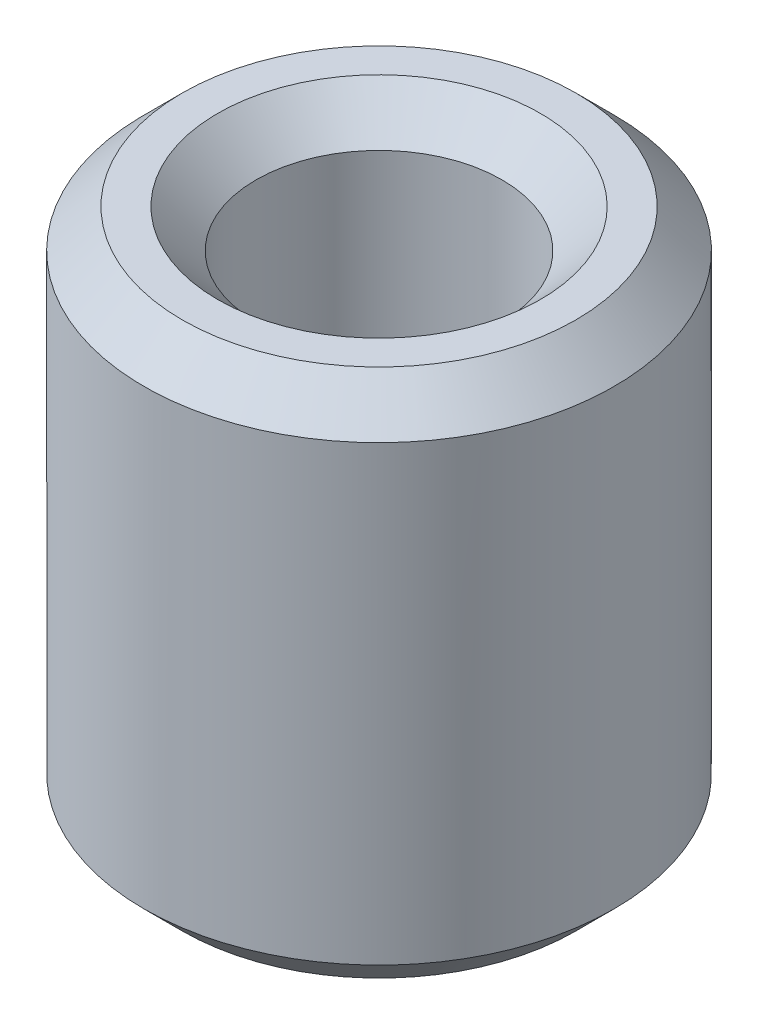
ISO-10303-21;
HEADER;
FILE_DESCRIPTION(('STEP AP214'),'2;1');
FILE_NAME('part.step','',(''),(''),'','','');
FILE_SCHEMA(('AUTOMOTIVE_DESIGN { 1 0 10303 214 1 1 1 1 }'));
ENDSEC;
DATA;
#1=APPLICATION_CONTEXT('core data for automotive mechanical design processes');
#2=APPLICATION_PROTOCOL_DEFINITION('international standard','automotive_design',2000,#1);
#3=PRODUCT_CONTEXT('',#1,'mechanical');
#4=PRODUCT('Part','Part','',(#3));
#5=PRODUCT_RELATED_PRODUCT_CATEGORY('part','',(#4));
#6=PRODUCT_DEFINITION_FORMATION('','',#4);
#7=PRODUCT_DEFINITION_CONTEXT('part definition',#1,'design');
#8=PRODUCT_DEFINITION('design','',#6,#7);
#9=PRODUCT_DEFINITION_SHAPE('','',#8);
#10=(LENGTH_UNIT() NAMED_UNIT(*) SI_UNIT(.MILLI.,.METRE.));
#11=(NAMED_UNIT(*) PLANE_ANGLE_UNIT() SI_UNIT($,.RADIAN.));
#12=(NAMED_UNIT(*) SI_UNIT($,.STERADIAN.) SOLID_ANGLE_UNIT());
#13=UNCERTAINTY_MEASURE_WITH_UNIT(LENGTH_MEASURE(1.E-05),#10,'distance_accuracy_value','');
#14=(GEOMETRIC_REPRESENTATION_CONTEXT(3) GLOBAL_UNCERTAINTY_ASSIGNED_CONTEXT((#13)) GLOBAL_UNIT_ASSIGNED_CONTEXT((#10,
#11,#12)) REPRESENTATION_CONTEXT('',''));
#15=CARTESIAN_POINT('',(0.,0.,0.));
#16=DIRECTION('',(0.,0.,1.));
#17=DIRECTION('',(1.,0.,0.));
#18=AXIS2_PLACEMENT_3D('',#15,#16,#17);
#19=CARTESIAN_POINT('',(0.,50.6589726493338,0.));
#20=DIRECTION('',(0.,-1.,0.));
#21=DIRECTION('',(0.,0.,-1.));
#22=AXIS2_PLACEMENT_3D('',#19,#20,#21);
#23=CYLINDRICAL_SURFACE('',#22,22.5);
#24=CARTESIAN_POINT('',(0.,3.6738509919001,0.));
#25=DIRECTION('',(0.,1.,0.));
#26=DIRECTION('',(0.,0.,1.));
#27=AXIS2_PLACEMENT_3D('',#24,#25,#26);
#28=CIRCLE('',#27,22.5);
#29=CARTESIAN_POINT('',(0.,3.6738509919001,-22.5));
#30=VERTEX_POINT('',#29);
#31=EDGE_CURVE('E10',#30,#30,#28,.T.);
#32=CARTESIAN_POINT('',(0.,46.9851216574337,0.));
#33=DIRECTION('',(0.,1.,0.));
#34=DIRECTION('',(0.,0.,1.));
#35=AXIS2_PLACEMENT_3D('',#32,#33,#34);
#36=CIRCLE('',#35,22.5);
#37=CARTESIAN_POINT('',(0.,46.9851216574337,-22.5));
#38=VERTEX_POINT('',#37);
#39=EDGE_CURVE('E50',#38,#38,#36,.F.);
#40=CARTESIAN_POINT('',(0.,3.6738509919001,-22.5));
#41=CARTESIAN_POINT('',(0.,4.12501006133274,-22.5));
#42=CARTESIAN_POINT('',(0.,4.57616913076539,-22.5));
#43=CARTESIAN_POINT('',(0.,5.47848726963067,-22.5));
#44=CARTESIAN_POINT('',(0.,5.92964633906331,-22.5));
#45=CARTESIAN_POINT('',(0.,6.8319644779286,-22.5));
#46=CARTESIAN_POINT('',(0.,7.28312354736124,-22.5));
#47=CARTESIAN_POINT('',(0.,8.18544168622652,-22.5));
#48=CARTESIAN_POINT('',(0.,8.63660075565917,-22.5));
#49=CARTESIAN_POINT('',(0.,9.53891889452445,-22.5));
#50=CARTESIAN_POINT('',(0.,9.99007796395709,-22.5));
#51=CARTESIAN_POINT('',(0.,10.8923961028224,-22.5));
#52=CARTESIAN_POINT('',(0.,11.343555172255,-22.5));
#53=CARTESIAN_POINT('',(0.,12.2458733111203,-22.5));
#54=CARTESIAN_POINT('',(0.,12.6970323805529,-22.5));
#55=CARTESIAN_POINT('',(0.,13.5993505194182,-22.5));
#56=CARTESIAN_POINT('',(0.,14.0505095888509,-22.5));
#57=CARTESIAN_POINT('',(0.,14.9528277277162,-22.5));
#58=CARTESIAN_POINT('',(0.,15.4039867971488,-22.5));
#59=CARTESIAN_POINT('',(0.,16.3063049360141,-22.5));
#60=CARTESIAN_POINT('',(0.,16.7574640054467,-22.5));
#61=CARTESIAN_POINT('',(0.,17.659782144312,-22.5));
#62=CARTESIAN_POINT('',(0.,18.1109412137446,-22.5));
#63=CARTESIAN_POINT('',(0.,19.0132593526099,-22.5));
#64=CARTESIAN_POINT('',(0.,19.4644184220426,-22.5));
#65=CARTESIAN_POINT('',(0.,20.3667365609079,-22.5));
#66=CARTESIAN_POINT('',(0.,20.8178956303405,-22.5));
#67=CARTESIAN_POINT('',(0.,21.7202137692058,-22.5));
#68=CARTESIAN_POINT('',(0.,22.1713728386384,-22.5));
#69=CARTESIAN_POINT('',(0.,23.0736909775037,-22.5));
#70=CARTESIAN_POINT('',(0.,23.5248500469364,-22.5));
#71=CARTESIAN_POINT('',(0.,24.4271681858016,-22.5));
#72=CARTESIAN_POINT('',(0.,24.8783272552343,-22.5));
#73=CARTESIAN_POINT('',(0.,25.7806453940996,-22.5));
#74=CARTESIAN_POINT('',(0.,26.2318044635322,-22.5));
#75=CARTESIAN_POINT('',(0.,27.1341226023975,-22.5));
#76=CARTESIAN_POINT('',(0.,27.5852816718301,-22.5));
#77=CARTESIAN_POINT('',(0.,28.4875998106954,-22.5));
#78=CARTESIAN_POINT('',(0.,28.9387588801281,-22.5));
#79=CARTESIAN_POINT('',(0.,29.8410770189933,-22.5));
#80=CARTESIAN_POINT('',(0.,30.292236088426,-22.5));
#81=CARTESIAN_POINT('',(0.,31.1945542272913,-22.5));
#82=CARTESIAN_POINT('',(0.,31.6457132967239,-22.5));
#83=CARTESIAN_POINT('',(0.,32.5480314355892,-22.5));
#84=CARTESIAN_POINT('',(0.,32.9991905050218,-22.5));
#85=CARTESIAN_POINT('',(0.,33.9015086438871,-22.5));
#86=CARTESIAN_POINT('',(0.,34.3526677133198,-22.5));
#87=CARTESIAN_POINT('',(0.,35.254985852185,-22.5));
#88=CARTESIAN_POINT('',(0.,35.7061449216177,-22.5));
#89=CARTESIAN_POINT('',(0.,36.608463060483,-22.5));
#90=CARTESIAN_POINT('',(0.,37.0596221299156,-22.5));
#91=CARTESIAN_POINT('',(0.,37.9619402687809,-22.5));
#92=CARTESIAN_POINT('',(0.,38.4130993382135,-22.5));
#93=CARTESIAN_POINT('',(0.,39.3154174770788,-22.5));
#94=CARTESIAN_POINT('',(0.,39.7665765465115,-22.5));
#95=CARTESIAN_POINT('',(0.,40.6688946853767,-22.5));
#96=CARTESIAN_POINT('',(0.,41.1200537548094,-22.5));
#97=CARTESIAN_POINT('',(0.,42.0223718936747,-22.5));
#98=CARTESIAN_POINT('',(0.,42.4735309631073,-22.5));
#99=CARTESIAN_POINT('',(0.,43.3758491019726,-22.5));
#100=CARTESIAN_POINT('',(0.,43.8270081714052,-22.5));
#101=CARTESIAN_POINT('',(0.,44.7293263102705,-22.5));
#102=CARTESIAN_POINT('',(0.,45.1804853797032,-22.5));
#103=CARTESIAN_POINT('',(0.,46.0828035185685,-22.5));
#104=CARTESIAN_POINT('',(0.,46.5339625880011,-22.5));
#105=CARTESIAN_POINT('',(0.,46.9851216574337,-22.5));
#106=B_SPLINE_CURVE_WITH_KNOTS('',3,(#40,#41,#42,#43,#44,#45,#46,#47,#48,#49,#50,#51,#52,#53,
#54,#55,#56,#57,#58,#59,#60,#61,#62,#63,#64,#65,#66,#67,#68,#69,#70,#71,#72,#73,#74,#75,#76,#77,
#78,#79,#80,#81,#82,#83,#84,#85,#86,#87,#88,#89,#90,#91,#92,#93,#94,#95,#96,#97,#98,#99,#100,
#101,#102,#103,#104,#105),.UNSPECIFIED.,.F.,.F.,(4,2,2,2,2,2,2,2,2,2,2,2,2,2,2,2,2,2,2,2,2,2,2,
2,2,2,2,2,2,2,2,2,4),(0.,1.35347720829793,2.70695441659585,4.06043162489378,5.41390883319171,
6.76738604148963,8.12086324978756,9.47434045808548,10.8278176663834,12.1812948746813,
13.5347720829793,14.8882492912772,16.2417264995751,17.595203707873,18.948680916171,
20.3021581244689,21.6556353327668,23.0091125410647,24.3625897493627,25.7160669576606,
27.0695441659585,28.4230213742564,29.7764985825544,31.1299757908523,32.4834529991502,
33.8369302074481,35.1904074157461,36.543884624044,37.8973618323419,39.2508390406399,
40.6043162489378,41.9577934572357,43.3112706655336),.UNSPECIFIED.);
#107=EDGE_CURVE('BSEAM39',#30,#38,#106,.T.);
#108=ORIENTED_EDGE('',*,*,#31,.T.);
#109=ORIENTED_EDGE('',*,*,#39,.T.);
#110=ORIENTED_EDGE('',*,*,#107,.T.);
#111=ORIENTED_EDGE('',*,*,#107,.F.);
#112=EDGE_LOOP('',(#108,#110,#109,#111));
#113=FACE_BOUND('',#112,.T.);
#114=ADVANCED_FACE('F39',(#113),#23,.T.);
#115=CARTESIAN_POINT('',(0.,50.6589726493338,0.));
#116=DIRECTION('',(0.,1.,0.));
#117=DIRECTION('',(0.,0.,1.));
#118=AXIS2_PLACEMENT_3D('',#115,#116,#117);
#119=PLANE('',#118);
#120=CARTESIAN_POINT('',(0.,50.6589726493338,0.));
#121=DIRECTION('',(0.,1.,0.));
#122=DIRECTION('',(0.,0.,1.));
#123=AXIS2_PLACEMENT_3D('',#120,#121,#122);
#124=CIRCLE('',#123,15.4427734811737);
#125=CARTESIAN_POINT('',(0.,50.6589726493338,15.4427734811737));
#126=VERTEX_POINT('',#125);
#127=EDGE_CURVE('E58',#126,#126,#124,.F.);
#128=ORIENTED_EDGE('',*,*,#127,.T.);
#129=EDGE_LOOP('',(#128));
#130=FACE_BOUND('',#129,.T.);
#131=CARTESIAN_POINT('',(0.,50.6589726493338,0.));
#132=DIRECTION('',(0.,1.,0.));
#133=DIRECTION('',(0.,0.,1.));
#134=AXIS2_PLACEMENT_3D('',#131,#132,#133);
#135=CIRCLE('',#134,18.8261490081);
#136=CARTESIAN_POINT('',(0.,50.6589726493338,-18.8261490081));
#137=VERTEX_POINT('',#136);
#138=EDGE_CURVE('E61',#137,#137,#135,.T.);
#139=ORIENTED_EDGE('',*,*,#138,.T.);
#140=EDGE_LOOP('',(#139));
#141=FACE_BOUND('',#140,.T.);
#142=ADVANCED_FACE('F88',(#130,#141),#119,.T.);
#143=CARTESIAN_POINT('',(0.,0.,0.));
#144=DIRECTION('',(0.,1.,0.));
#145=DIRECTION('',(0.,0.,1.));
#146=AXIS2_PLACEMENT_3D('',#143,#144,#145);
#147=PLANE('',#146);
#148=CARTESIAN_POINT('',(0.,0.,0.));
#149=DIRECTION('',(0.,1.,0.));
#150=DIRECTION('',(0.,0.,1.));
#151=AXIS2_PLACEMENT_3D('',#148,#149,#150);
#152=CIRCLE('',#151,15.4427734811736);
#153=CARTESIAN_POINT('',(0.,0.,15.4427734811736));
#154=VERTEX_POINT('',#153);
#155=EDGE_CURVE('E51',#154,#154,#152,.T.);
#156=ORIENTED_EDGE('',*,*,#155,.T.);
#157=EDGE_LOOP('',(#156));
#158=FACE_BOUND('',#157,.T.);
#159=CARTESIAN_POINT('',(0.,0.,0.));
#160=DIRECTION('',(0.,1.,0.));
#161=DIRECTION('',(0.,0.,1.));
#162=AXIS2_PLACEMENT_3D('',#159,#160,#161);
#163=CIRCLE('',#162,18.8261490080999);
#164=CARTESIAN_POINT('',(0.,0.,18.8261490080999));
#165=VERTEX_POINT('',#164);
#166=EDGE_CURVE('E54',#165,#165,#163,.F.);
#167=ORIENTED_EDGE('',*,*,#166,.T.);
#168=EDGE_LOOP('',(#167));
#169=FACE_BOUND('',#168,.T.);
#170=ADVANCED_FACE('F83',(#158,#169),#147,.F.);
#171=CARTESIAN_POINT('',(0.,50.6589726493338,0.));
#172=DIRECTION('',(0.,-1.,0.));
#173=DIRECTION('',(0.,0.,-1.));
#174=AXIS2_PLACEMENT_3D('',#171,#172,#173);
#175=CYLINDRICAL_SURFACE('',#174,11.7689224892736);
#176=CARTESIAN_POINT('',(0.,46.9851216574337,0.));
#177=DIRECTION('',(0.,1.,0.));
#178=DIRECTION('',(0.,0.,1.));
#179=AXIS2_PLACEMENT_3D('',#176,#177,#178);
#180=CIRCLE('',#179,11.7689224892736);
#181=CARTESIAN_POINT('',(0.,46.9851216574337,-11.7689224892736));
#182=VERTEX_POINT('',#181);
#183=EDGE_CURVE('E67',#182,#182,#180,.T.);
#184=CARTESIAN_POINT('',(0.,3.67385099190006,0.));
#185=DIRECTION('',(0.,1.,0.));
#186=DIRECTION('',(0.,0.,1.));
#187=AXIS2_PLACEMENT_3D('',#184,#185,#186);
#188=CIRCLE('',#187,11.7689224892736);
#189=CARTESIAN_POINT('',(0.,3.67385099190006,-11.7689224892736));
#190=VERTEX_POINT('',#189);
#191=EDGE_CURVE('E69',#190,#190,#188,.F.);
#192=CARTESIAN_POINT('',(0.,46.9851216574337,-11.7689224892736));
#193=CARTESIAN_POINT('',(0.,46.5339625880011,-11.7689224892736));
#194=CARTESIAN_POINT('',(0.,46.0828035185684,-11.7689224892736));
#195=CARTESIAN_POINT('',(0.,45.1804853797031,-11.7689224892736));
#196=CARTESIAN_POINT('',(0.,44.7293263102705,-11.7689224892736));
#197=CARTESIAN_POINT('',(0.,43.8270081714052,-11.7689224892736));
#198=CARTESIAN_POINT('',(0.,43.3758491019726,-11.7689224892736));
#199=CARTESIAN_POINT('',(0.,42.4735309631073,-11.7689224892736));
#200=CARTESIAN_POINT('',(0.,42.0223718936746,-11.7689224892736));
#201=CARTESIAN_POINT('',(0.,41.1200537548094,-11.7689224892736));
#202=CARTESIAN_POINT('',(0.,40.6688946853767,-11.7689224892736));
#203=CARTESIAN_POINT('',(0.,39.7665765465114,-11.7689224892736));
#204=CARTESIAN_POINT('',(0.,39.3154174770788,-11.7689224892736));
#205=CARTESIAN_POINT('',(0.,38.4130993382135,-11.7689224892736));
#206=CARTESIAN_POINT('',(0.,37.9619402687809,-11.7689224892736));
#207=CARTESIAN_POINT('',(0.,37.0596221299156,-11.7689224892736));
#208=CARTESIAN_POINT('',(0.,36.6084630604829,-11.7689224892736));
#209=CARTESIAN_POINT('',(0.,35.7061449216176,-11.7689224892736));
#210=CARTESIAN_POINT('',(0.,35.254985852185,-11.7689224892736));
#211=CARTESIAN_POINT('',(0.,34.3526677133197,-11.7689224892736));
#212=CARTESIAN_POINT('',(0.,33.9015086438871,-11.7689224892736));
#213=CARTESIAN_POINT('',(0.,32.9991905050218,-11.7689224892736));
#214=CARTESIAN_POINT('',(0.,32.5480314355892,-11.7689224892736));
#215=CARTESIAN_POINT('',(0.,31.6457132967239,-11.7689224892736));
#216=CARTESIAN_POINT('',(0.,31.1945542272912,-11.7689224892736));
#217=CARTESIAN_POINT('',(0.,30.2922360884259,-11.7689224892736));
#218=CARTESIAN_POINT('',(0.,29.8410770189933,-11.7689224892736));
#219=CARTESIAN_POINT('',(0.,28.938758880128,-11.7689224892736));
#220=CARTESIAN_POINT('',(0.,28.4875998106954,-11.7689224892736));
#221=CARTESIAN_POINT('',(0.,27.5852816718301,-11.7689224892736));
#222=CARTESIAN_POINT('',(0.,27.1341226023975,-11.7689224892736));
#223=CARTESIAN_POINT('',(0.,26.2318044635322,-11.7689224892736));
#224=CARTESIAN_POINT('',(0.,25.7806453940995,-11.7689224892736));
#225=CARTESIAN_POINT('',(0.,24.8783272552342,-11.7689224892736));
#226=CARTESIAN_POINT('',(0.,24.4271681858016,-11.7689224892736));
#227=CARTESIAN_POINT('',(0.,23.5248500469363,-11.7689224892736));
#228=CARTESIAN_POINT('',(0.,23.0736909775037,-11.7689224892736));
#229=CARTESIAN_POINT('',(0.,22.1713728386384,-11.7689224892736));
#230=CARTESIAN_POINT('',(0.,21.7202137692057,-11.7689224892736));
#231=CARTESIAN_POINT('',(0.,20.8178956303405,-11.7689224892736));
#232=CARTESIAN_POINT('',(0.,20.3667365609078,-11.7689224892736));
#233=CARTESIAN_POINT('',(0.,19.4644184220425,-11.7689224892736));
#234=CARTESIAN_POINT('',(0.,19.0132593526099,-11.7689224892736));
#235=CARTESIAN_POINT('',(0.,18.1109412137446,-11.7689224892736));
#236=CARTESIAN_POINT('',(0.,17.659782144312,-11.7689224892736));
#237=CARTESIAN_POINT('',(0.,16.7574640054467,-11.7689224892736));
#238=CARTESIAN_POINT('',(0.,16.306304936014,-11.7689224892736));
#239=CARTESIAN_POINT('',(0.,15.4039867971488,-11.7689224892736));
#240=CARTESIAN_POINT('',(0.,14.9528277277161,-11.7689224892736));
#241=CARTESIAN_POINT('',(0.,14.0505095888508,-11.7689224892736));
#242=CARTESIAN_POINT('',(0.,13.5993505194182,-11.7689224892736));
#243=CARTESIAN_POINT('',(0.,12.6970323805529,-11.7689224892736));
#244=CARTESIAN_POINT('',(0.,12.2458733111203,-11.7689224892736));
#245=CARTESIAN_POINT('',(0.,11.343555172255,-11.7689224892736));
#246=CARTESIAN_POINT('',(0.,10.8923961028223,-11.7689224892736));
#247=CARTESIAN_POINT('',(0.,9.99007796395705,-11.7689224892736));
#248=CARTESIAN_POINT('',(0.,9.53891889452441,-11.7689224892736));
#249=CARTESIAN_POINT('',(0.,8.63660075565912,-11.7689224892736));
#250=CARTESIAN_POINT('',(0.,8.18544168622648,-11.7689224892736));
#251=CARTESIAN_POINT('',(0.,7.2831235473612,-11.7689224892736));
#252=CARTESIAN_POINT('',(0.,6.83196447792856,-11.7689224892736));
#253=CARTESIAN_POINT('',(0.,5.92964633906327,-11.7689224892736));
#254=CARTESIAN_POINT('',(0.,5.47848726963063,-11.7689224892736));
#255=CARTESIAN_POINT('',(0.,4.57616913076535,-11.7689224892736));
#256=CARTESIAN_POINT('',(0.,4.1250100613327,-11.7689224892736));
#257=CARTESIAN_POINT('',(0.,3.67385099190006,-11.7689224892736));
#258=B_SPLINE_CURVE_WITH_KNOTS('',3,(#192,#193,#194,#195,#196,#197,#198,#199,#200,#201,#202,
#203,#204,#205,#206,#207,#208,#209,#210,#211,#212,#213,#214,#215,#216,#217,#218,#219,#220,#221,
#222,#223,#224,#225,#226,#227,#228,#229,#230,#231,#232,#233,#234,#235,#236,#237,#238,#239,#240,
#241,#242,#243,#244,#245,#246,#247,#248,#249,#250,#251,#252,#253,#254,#255,#256,#257),
.UNSPECIFIED.,.F.,.F.,(4,2,2,2,2,2,2,2,2,2,2,2,2,2,2,2,2,2,2,2,2,2,2,2,2,2,2,2,2,2,2,2,4),(0.,
1.35347720829793,2.70695441659585,4.06043162489378,5.41390883319171,6.76738604148963,
8.12086324978756,9.47434045808548,10.8278176663834,12.1812948746813,13.5347720829793,
14.8882492912772,16.2417264995751,17.595203707873,18.948680916171,20.3021581244689,
21.6556353327668,23.0091125410647,24.3625897493627,25.7160669576606,27.0695441659585,
28.4230213742565,29.7764985825544,31.1299757908523,32.4834529991502,33.8369302074482,
35.1904074157461,36.543884624044,37.8973618323419,39.2508390406399,40.6043162489378,
41.9577934572357,43.3112706655336),.UNSPECIFIED.);
#259=EDGE_CURVE('BSEAM71',#182,#190,#258,.T.);
#260=ORIENTED_EDGE('',*,*,#183,.T.);
#261=ORIENTED_EDGE('',*,*,#191,.T.);
#262=ORIENTED_EDGE('',*,*,#259,.T.);
#263=ORIENTED_EDGE('',*,*,#259,.F.);
#264=EDGE_LOOP('',(#260,#262,#261,#263));
#265=FACE_BOUND('',#264,.T.);
#266=ADVANCED_FACE('F71',(#265),#175,.F.);
#267=CARTESIAN_POINT('',(0.,46.9851216574337,0.));
#268=DIRECTION('',(0.,1.,0.));
#269=DIRECTION('',(0.,0.,1.));
#270=AXIS2_PLACEMENT_3D('',#267,#268,#269);
#271=CONICAL_SURFACE('',#270,11.7689224892736,0.785398163397452);
#272=ORIENTED_EDGE('',*,*,#127,.F.);
#273=EDGE_LOOP('',(#272));
#274=FACE_BOUND('',#273,.T.);
#275=ORIENTED_EDGE('',*,*,#183,.F.);
#276=EDGE_LOOP('',(#275));
#277=FACE_BOUND('',#276,.T.);
#278=ADVANCED_FACE('F77',(#274,#277),#271,.F.);
#279=CARTESIAN_POINT('',(0.,0.,0.));
#280=DIRECTION('',(0.,-1.,0.));
#281=DIRECTION('',(0.,0.,-1.));
#282=AXIS2_PLACEMENT_3D('',#279,#280,#281);
#283=CONICAL_SURFACE('',#282,15.4427734811736,0.785398163397444);
#284=ORIENTED_EDGE('',*,*,#191,.F.);
#285=EDGE_LOOP('',(#284));
#286=FACE_BOUND('',#285,.T.);
#287=ORIENTED_EDGE('',*,*,#155,.F.);
#288=EDGE_LOOP('',(#287));
#289=FACE_BOUND('',#288,.T.);
#290=ADVANCED_FACE('F73',(#286,#289),#283,.F.);
#291=CARTESIAN_POINT('',(0.,3.6738509919001,0.));
#292=DIRECTION('',(0.,1.,0.));
#293=DIRECTION('',(0.,0.,1.));
#294=AXIS2_PLACEMENT_3D('',#291,#292,#293);
#295=CONICAL_SURFACE('',#294,22.5,0.785398163397451);
#296=ORIENTED_EDGE('',*,*,#166,.F.);
#297=EDGE_LOOP('',(#296));
#298=FACE_BOUND('',#297,.T.);
#299=ORIENTED_EDGE('',*,*,#31,.F.);
#300=EDGE_LOOP('',(#299));
#301=FACE_BOUND('',#300,.T.);
#302=ADVANCED_FACE('F76',(#298,#301),#295,.T.);
#303=CARTESIAN_POINT('',(0.,50.6589726493338,0.));
#304=DIRECTION('',(0.,-1.,0.));
#305=DIRECTION('',(0.,0.,-1.));
#306=AXIS2_PLACEMENT_3D('',#303,#304,#305);
#307=CONICAL_SURFACE('',#306,18.8261490081,0.785398163397444);
#308=CARTESIAN_POINT('',(0.,46.9851216574337,-22.5));
#309=CARTESIAN_POINT('',(0.,47.0233909385994,-22.4617307188344));
#310=CARTESIAN_POINT('',(0.,47.061660219765,-22.4234614376688));
#311=CARTESIAN_POINT('',(0.,47.1381987820962,-22.3469228753375));
#312=CARTESIAN_POINT('',(0.,47.1764680632619,-22.3086535941719));
#313=CARTESIAN_POINT('',(0.,47.2530066255931,-22.2321150318406));
#314=CARTESIAN_POINT('',(0.,47.2912759067587,-22.193845750675));
#315=CARTESIAN_POINT('',(0.,47.36781446909,-22.1173071883438));
#316=CARTESIAN_POINT('',(0.,47.4060837502556,-22.0790379071781));
#317=CARTESIAN_POINT('',(0.,47.4826223125869,-22.0024993448469));
#318=CARTESIAN_POINT('',(0.,47.5208915937525,-21.9642300636813));
#319=CARTESIAN_POINT('',(0.,47.5974301560838,-21.88769150135));
#320=CARTESIAN_POINT('',(0.,47.6356994372494,-21.8494222201844));
#321=CARTESIAN_POINT('',(0.,47.7122379995806,-21.7728836578531));
#322=CARTESIAN_POINT('',(0.,47.7505072807463,-21.7346143766875));
#323=CARTESIAN_POINT('',(0.,47.8270458430775,-21.6580758143562));
#324=CARTESIAN_POINT('',(0.,47.8653151242431,-21.6198065331906));
#325=CARTESIAN_POINT('',(0.,47.9418536865744,-21.5432679708594));
#326=CARTESIAN_POINT('',(0.,47.98012296774,-21.5049986896937));
#327=CARTESIAN_POINT('',(0.,48.0566615300713,-21.4284601273625));
#328=CARTESIAN_POINT('',(0.,48.0949308112369,-21.3901908461969));
#329=CARTESIAN_POINT('',(0.,48.1714693735681,-21.3136522838656));
#330=CARTESIAN_POINT('',(0.,48.2097386547338,-21.2753830027));
#331=CARTESIAN_POINT('',(0.,48.286277217065,-21.1988444403687));
#332=CARTESIAN_POINT('',(0.,48.3245464982306,-21.1605751592031));
#333=CARTESIAN_POINT('',(0.,48.4010850605619,-21.0840365968719));
#334=CARTESIAN_POINT('',(0.,48.4393543417275,-21.0457673157062));
#335=CARTESIAN_POINT('',(0.,48.5158929040588,-20.969228753375));
#336=CARTESIAN_POINT('',(0.,48.5541621852244,-20.9309594722094));
#337=CARTESIAN_POINT('',(0.,48.6307007475557,-20.8544209098781));
#338=CARTESIAN_POINT('',(0.,48.6689700287213,-20.8161516287125));
#339=CARTESIAN_POINT('',(0.,48.7455085910525,-20.7396130663812));
#340=CARTESIAN_POINT('',(0.,48.7837778722182,-20.7013437852156));
#341=CARTESIAN_POINT('',(0.,48.8603164345494,-20.6248052228844));
#342=CARTESIAN_POINT('',(0.,48.898585715715,-20.5865359417187));
#343=CARTESIAN_POINT('',(0.,48.9751242780463,-20.5099973793875));
#344=CARTESIAN_POINT('',(0.,49.0133935592119,-20.4717280982219));
#345=CARTESIAN_POINT('',(0.,49.0899321215432,-20.3951895358906));
#346=CARTESIAN_POINT('',(0.,49.1282014027088,-20.356920254725));
#347=CARTESIAN_POINT('',(0.,49.20473996504,-20.2803816923937));
#348=CARTESIAN_POINT('',(0.,49.2430092462057,-20.2421124112281));
#349=CARTESIAN_POINT('',(0.,49.3195478085369,-20.1655738488969));
#350=CARTESIAN_POINT('',(0.,49.3578170897025,-20.1273045677312));
#351=CARTESIAN_POINT('',(0.,49.4343556520338,-20.0507660054));
#352=CARTESIAN_POINT('',(0.,49.4726249331994,-20.0124967242344));
#353=CARTESIAN_POINT('',(0.,49.5491634955307,-19.9359581619031));
#354=CARTESIAN_POINT('',(0.,49.5874327766963,-19.8976888807375));
#355=CARTESIAN_POINT('',(0.,49.6639713390275,-19.8211503184062));
#356=CARTESIAN_POINT('',(0.,49.7022406201932,-19.7828810372406));
#357=CARTESIAN_POINT('',(0.,49.7787791825244,-19.7063424749093));
#358=CARTESIAN_POINT('',(0.,49.81704846369,-19.6680731937437));
#359=CARTESIAN_POINT('',(0.,49.8935870260213,-19.5915346314125));
#360=CARTESIAN_POINT('',(0.,49.9318563071869,-19.5532653502468));
#361=CARTESIAN_POINT('',(0.,50.0083948695182,-19.4767267879156));
#362=CARTESIAN_POINT('',(0.,50.0466641506838,-19.43845750675));
#363=CARTESIAN_POINT('',(0.,50.1232027130151,-19.3619189444187));
#364=CARTESIAN_POINT('',(0.,50.1614719941807,-19.3236496632531));
#365=CARTESIAN_POINT('',(0.,50.2380105565119,-19.2471111009218));
#366=CARTESIAN_POINT('',(0.,50.2762798376776,-19.2088418197562));
#367=CARTESIAN_POINT('',(0.,50.3528184000088,-19.132303257425));
#368=CARTESIAN_POINT('',(0.,50.3910876811744,-19.0940339762593));
#369=CARTESIAN_POINT('',(0.,50.4676262435057,-19.0174954139281));
#370=CARTESIAN_POINT('',(0.,50.5058955246713,-18.9792261327625));
#371=CARTESIAN_POINT('',(0.,50.5824340870026,-18.9026875704312));
#372=CARTESIAN_POINT('',(0.,50.6207033681682,-18.8644182892656));
#373=CARTESIAN_POINT('',(0.,50.6589726493338,-18.8261490081));
#374=B_SPLINE_CURVE_WITH_KNOTS('',3,(#308,#309,#310,#311,#312,#313,#314,#315,#316,#317,#318,
#319,#320,#321,#322,#323,#324,#325,#326,#327,#328,#329,#330,#331,#332,#333,#334,#335,#336,#337,
#338,#339,#340,#341,#342,#343,#344,#345,#346,#347,#348,#349,#350,#351,#352,#353,#354,#355,#356,
#357,#358,#359,#360,#361,#362,#363,#364,#365,#366,#367,#368,#369,#370,#371,#372,#373),
.UNSPECIFIED.,.F.,.F.,(4,2,2,2,2,2,2,2,2,2,2,2,2,2,2,2,2,2,2,2,2,2,2,2,2,2,2,2,2,2,2,2,4),(0.,
0.162362809340085,0.324725618680178,0.487088428020268,0.649451237360361,0.811814046700451,
0.974176856040543,1.13653966538063,1.29890247472073,1.46126528406082,1.62362809340091,
1.785990902741,1.94835371208109,2.11071652142118,2.27307933076127,2.43544214010136,
2.59780494944145,2.76016775878154,2.92253056812163,3.08489337746173,3.24725618680182,
3.40961899614191,3.571981805482,3.73434461482209,3.89670742416218,4.05907023350227,
4.22143304284236,4.38379585218245,4.54615866152254,4.70852147086263,4.87088428020273,
5.03324708954282,5.19560989888291),.UNSPECIFIED.);
#375=EDGE_CURVE('BSEAM45',#38,#137,#374,.T.);
#376=ORIENTED_EDGE('',*,*,#39,.F.);
#377=ORIENTED_EDGE('',*,*,#138,.F.);
#378=ORIENTED_EDGE('',*,*,#375,.T.);
#379=ORIENTED_EDGE('',*,*,#375,.F.);
#380=EDGE_LOOP('',(#376,#378,#377,#379));
#381=FACE_BOUND('',#380,.T.);
#382=ADVANCED_FACE('F45',(#381),#307,.T.);
#383=CLOSED_SHELL('',(#114,#142,#170,#266,#278,#290,#302,#382));
#384=MANIFOLD_SOLID_BREP('B2',#383);
#385=ADVANCED_BREP_SHAPE_REPRESENTATION('',(#18,#384),#14);
#386=SHAPE_DEFINITION_REPRESENTATION(#9,#385);
ENDSEC;
END-ISO-10303-21;
